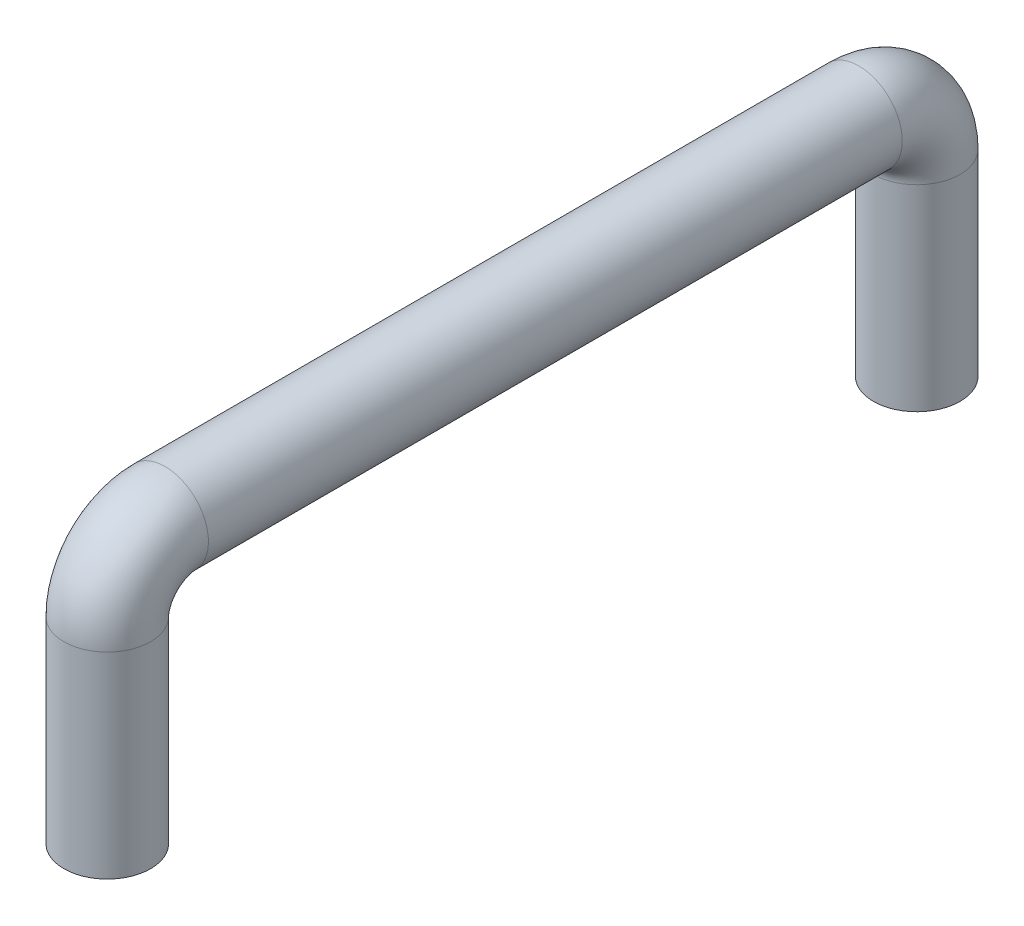
ISO-10303-21;
HEADER;
FILE_DESCRIPTION(('STEP AP214'),'2;1');
FILE_NAME('part.step','',(''),(''),'','','');
FILE_SCHEMA(('AUTOMOTIVE_DESIGN { 1 0 10303 214 1 1 1 1 }'));
ENDSEC;
DATA;
#1=APPLICATION_CONTEXT('core data for automotive mechanical design processes');
#2=APPLICATION_PROTOCOL_DEFINITION('international standard','automotive_design',2000,#1);
#3=PRODUCT_CONTEXT('',#1,'mechanical');
#4=PRODUCT('Part','Part','',(#3));
#5=PRODUCT_RELATED_PRODUCT_CATEGORY('part','',(#4));
#6=PRODUCT_DEFINITION_FORMATION('','',#4);
#7=PRODUCT_DEFINITION_CONTEXT('part definition',#1,'design');
#8=PRODUCT_DEFINITION('design','',#6,#7);
#9=PRODUCT_DEFINITION_SHAPE('','',#8);
#10=(LENGTH_UNIT() NAMED_UNIT(*) SI_UNIT(.MILLI.,.METRE.));
#11=(NAMED_UNIT(*) PLANE_ANGLE_UNIT() SI_UNIT($,.RADIAN.));
#12=(NAMED_UNIT(*) SI_UNIT($,.STERADIAN.) SOLID_ANGLE_UNIT());
#13=UNCERTAINTY_MEASURE_WITH_UNIT(LENGTH_MEASURE(1.E-05),#10,'distance_accuracy_value','');
#14=(GEOMETRIC_REPRESENTATION_CONTEXT(3) GLOBAL_UNCERTAINTY_ASSIGNED_CONTEXT((#13)) GLOBAL_UNIT_ASSIGNED_CONTEXT((#10,
#11,#12)) REPRESENTATION_CONTEXT('',''));
#15=CARTESIAN_POINT('',(0.,0.,0.));
#16=DIRECTION('',(0.,0.,1.));
#17=DIRECTION('',(1.,0.,0.));
#18=AXIS2_PLACEMENT_3D('',#15,#16,#17);
#19=CARTESIAN_POINT('',(0.,21.59,-88.9));
#20=DIRECTION('',(0.,-1.,0.));
#21=DIRECTION('',(0.,0.,-1.));
#22=AXIS2_PLACEMENT_3D('',#19,#20,#21);
#23=CYLINDRICAL_SURFACE('',#22,4.7625);
#24=CARTESIAN_POINT('',(0.,21.59,-88.9));
#25=DIRECTION('',(0.,-1.,0.));
#26=DIRECTION('',(0.,0.,-1.));
#27=AXIS2_PLACEMENT_3D('',#24,#25,#26);
#28=CIRCLE('',#27,4.7625);
#29=CARTESIAN_POINT('',(0.,21.59,-93.6625));
#30=VERTEX_POINT('',#29);
#31=EDGE_CURVE('E42',#30,#30,#28,.T.);
#32=ORIENTED_EDGE('',*,*,#31,.T.);
#33=EDGE_LOOP('',(#32));
#34=FACE_BOUND('',#33,.T.);
#35=CARTESIAN_POINT('',(0.,0.,-88.9));
#36=DIRECTION('',(0.,-1.,0.));
#37=DIRECTION('',(0.,0.,-1.));
#38=AXIS2_PLACEMENT_3D('',#35,#36,#37);
#39=CIRCLE('',#38,4.7625);
#40=CARTESIAN_POINT('',(0.,0.,-93.6625));
#41=VERTEX_POINT('',#40);
#42=EDGE_CURVE('E10',#41,#41,#39,.T.);
#43=ORIENTED_EDGE('',*,*,#42,.F.);
#44=EDGE_LOOP('',(#43));
#45=FACE_BOUND('',#44,.T.);
#46=ADVANCED_FACE('F36',(#34,#45),#23,.T.);
#47=CARTESIAN_POINT('',(0.,21.59,-82.55));
#48=DIRECTION('',(-1.,0.,0.));
#49=DIRECTION('',(0.,0.,1.));
#50=AXIS2_PLACEMENT_3D('',#47,#48,#49);
#51=TOROIDAL_SURFACE('',#50,6.34999999999999,4.7625);
#52=CARTESIAN_POINT('',(0.,27.94,-82.55));
#53=DIRECTION('',(0.,0.,-1.));
#54=DIRECTION('',(0.,1.,0.));
#55=AXIS2_PLACEMENT_3D('',#52,#53,#54);
#56=CIRCLE('',#55,4.7625);
#57=CARTESIAN_POINT('',(0.,32.7025,-82.55));
#58=VERTEX_POINT('',#57);
#59=EDGE_CURVE('E46',#58,#58,#56,.T.);
#60=CARTESIAN_POINT('',(0.,21.59,-82.55));
#61=DIRECTION('',(-1.,0.,0.));
#62=DIRECTION('',(0.,0.,1.));
#63=AXIS2_PLACEMENT_3D('',#60,#61,#62);
#64=CIRCLE('',#63,11.1125);
#65=EDGE_CURVE('',#58,#30,#64,.T.);
#66=ORIENTED_EDGE('',*,*,#59,.T.);
#67=ORIENTED_EDGE('',*,*,#31,.F.);
#68=ORIENTED_EDGE('',*,*,#65,.T.);
#69=ORIENTED_EDGE('',*,*,#65,.F.);
#70=EDGE_LOOP('',(#66,#68,#67,#69));
#71=FACE_BOUND('',#70,.T.);
#72=ADVANCED_FACE('F92',(#71),#51,.T.);
#73=CARTESIAN_POINT('',(0.,27.94,-6.35));
#74=DIRECTION('',(0.,0.,-1.));
#75=DIRECTION('',(-1.,0.,0.));
#76=AXIS2_PLACEMENT_3D('',#73,#74,#75);
#77=CYLINDRICAL_SURFACE('',#76,4.7625);
#78=CARTESIAN_POINT('',(0.,27.94,-6.35));
#79=DIRECTION('',(0.,0.,-1.));
#80=DIRECTION('',(0.,1.,0.));
#81=AXIS2_PLACEMENT_3D('',#78,#79,#80);
#82=CIRCLE('',#81,4.7625);
#83=CARTESIAN_POINT('',(0.,32.7025,-6.35));
#84=VERTEX_POINT('',#83);
#85=EDGE_CURVE('E50',#84,#84,#82,.T.);
#86=ORIENTED_EDGE('',*,*,#85,.T.);
#87=EDGE_LOOP('',(#86));
#88=FACE_BOUND('',#87,.T.);
#89=ORIENTED_EDGE('',*,*,#59,.F.);
#90=EDGE_LOOP('',(#89));
#91=FACE_BOUND('',#90,.T.);
#92=ADVANCED_FACE('F96',(#88,#91),#77,.T.);
#93=CARTESIAN_POINT('',(0.,21.59,-6.35));
#94=DIRECTION('',(-1.,0.,0.));
#95=DIRECTION('',(0.,0.,1.));
#96=AXIS2_PLACEMENT_3D('',#93,#94,#95);
#97=TOROIDAL_SURFACE('',#96,6.35,4.7625);
#98=CARTESIAN_POINT('',(0.,21.59,0.));
#99=DIRECTION('',(0.,1.,0.));
#100=DIRECTION('',(0.,0.,1.));
#101=AXIS2_PLACEMENT_3D('',#98,#99,#100);
#102=CIRCLE('',#101,4.7625);
#103=CARTESIAN_POINT('',(0.,21.59,4.7625));
#104=VERTEX_POINT('',#103);
#105=EDGE_CURVE('E55',#104,#104,#102,.T.);
#106=CARTESIAN_POINT('',(0.,21.59,-6.35));
#107=DIRECTION('',(-1.,0.,0.));
#108=DIRECTION('',(0.,0.,1.));
#109=AXIS2_PLACEMENT_3D('',#106,#107,#108);
#110=CIRCLE('',#109,11.1125);
#111=EDGE_CURVE('',#104,#84,#110,.T.);
#112=ORIENTED_EDGE('',*,*,#105,.T.);
#113=ORIENTED_EDGE('',*,*,#85,.F.);
#114=ORIENTED_EDGE('',*,*,#111,.T.);
#115=ORIENTED_EDGE('',*,*,#111,.F.);
#116=EDGE_LOOP('',(#112,#114,#113,#115));
#117=FACE_BOUND('',#116,.T.);
#118=ADVANCED_FACE('F88',(#117),#97,.T.);
#119=CARTESIAN_POINT('',(0.,21.59,0.));
#120=DIRECTION('',(0.,-1.,0.));
#121=DIRECTION('',(0.,0.,-1.));
#122=AXIS2_PLACEMENT_3D('',#119,#120,#121);
#123=CYLINDRICAL_SURFACE('',#122,4.7625);
#124=ORIENTED_EDGE('',*,*,#105,.F.);
#125=EDGE_LOOP('',(#124));
#126=FACE_BOUND('',#125,.T.);
#127=CARTESIAN_POINT('',(0.,0.,0.));
#128=DIRECTION('',(0.,1.,0.));
#129=DIRECTION('',(0.,0.,1.));
#130=AXIS2_PLACEMENT_3D('',#127,#128,#129);
#131=CIRCLE('',#130,4.7625);
#132=CARTESIAN_POINT('',(0.,0.,4.7625));
#133=VERTEX_POINT('',#132);
#134=EDGE_CURVE('E58',#133,#133,#131,.T.);
#135=ORIENTED_EDGE('',*,*,#134,.T.);
#136=EDGE_LOOP('',(#135));
#137=FACE_BOUND('',#136,.T.);
#138=ADVANCED_FACE('F79',(#126,#137),#123,.T.);
#139=CARTESIAN_POINT('',(0.,0.,-88.9));
#140=DIRECTION('',(0.,-1.,0.));
#141=DIRECTION('',(0.,0.,-1.));
#142=AXIS2_PLACEMENT_3D('',#139,#140,#141);
#143=PLANE('',#142);
#144=CARTESIAN_POINT('',(0.,0.,-88.9));
#145=DIRECTION('',(0.,-1.,0.));
#146=DIRECTION('',(0.,0.,-1.));
#147=AXIS2_PLACEMENT_3D('',#144,#145,#146);
#148=CIRCLE('',#147,1.7272);
#149=CARTESIAN_POINT('',(0.,0.,-90.6272));
#150=VERTEX_POINT('',#149);
#151=EDGE_CURVE('E70',#150,#150,#148,.T.);
#152=ORIENTED_EDGE('',*,*,#151,.F.);
#153=EDGE_LOOP('',(#152));
#154=FACE_BOUND('',#153,.T.);
#155=ORIENTED_EDGE('',*,*,#42,.T.);
#156=EDGE_LOOP('',(#155));
#157=FACE_BOUND('',#156,.T.);
#158=ADVANCED_FACE('F76',(#154,#157),#143,.T.);
#159=CARTESIAN_POINT('',(0.,0.,0.));
#160=DIRECTION('',(0.,1.,0.));
#161=DIRECTION('',(0.,0.,1.));
#162=AXIS2_PLACEMENT_3D('',#159,#160,#161);
#163=PLANE('',#162);
#164=CARTESIAN_POINT('',(0.,0.,0.));
#165=DIRECTION('',(0.,-1.,0.));
#166=DIRECTION('',(0.,0.,-1.));
#167=AXIS2_PLACEMENT_3D('',#164,#165,#166);
#168=CIRCLE('',#167,1.7272);
#169=CARTESIAN_POINT('',(0.,0.,-1.7272));
#170=VERTEX_POINT('',#169);
#171=EDGE_CURVE('E64',#170,#170,#168,.T.);
#172=ORIENTED_EDGE('',*,*,#171,.F.);
#173=EDGE_LOOP('',(#172));
#174=FACE_BOUND('',#173,.T.);
#175=ORIENTED_EDGE('',*,*,#134,.F.);
#176=EDGE_LOOP('',(#175));
#177=FACE_BOUND('',#176,.T.);
#178=ADVANCED_FACE('F78',(#174,#177),#163,.F.);
#179=CARTESIAN_POINT('',(0.,12.7,0.));
#180=DIRECTION('',(0.,-1.,0.));
#181=DIRECTION('',(0.,0.,-1.));
#182=AXIS2_PLACEMENT_3D('',#179,#180,#181);
#183=CYLINDRICAL_SURFACE('',#182,1.7272);
#184=CARTESIAN_POINT('',(0.,12.7,0.));
#185=DIRECTION('',(0.,-1.,0.));
#186=DIRECTION('',(0.,0.,-1.));
#187=AXIS2_PLACEMENT_3D('',#184,#185,#186);
#188=CIRCLE('',#187,1.7272);
#189=CARTESIAN_POINT('',(0.,12.7,-1.7272));
#190=VERTEX_POINT('',#189);
#191=EDGE_CURVE('E61',#190,#190,#188,.T.);
#192=ORIENTED_EDGE('',*,*,#191,.F.);
#193=EDGE_LOOP('',(#192));
#194=FACE_BOUND('',#193,.T.);
#195=ORIENTED_EDGE('',*,*,#171,.T.);
#196=EDGE_LOOP('',(#195));
#197=FACE_BOUND('',#196,.T.);
#198=ADVANCED_FACE('F85',(#194,#197),#183,.F.);
#199=CARTESIAN_POINT('',(0.,12.7,0.));
#200=DIRECTION('',(0.,-1.,0.));
#201=DIRECTION('',(0.,0.,-1.));
#202=AXIS2_PLACEMENT_3D('',#199,#200,#201);
#203=PLANE('',#202);
#204=ORIENTED_EDGE('',*,*,#191,.T.);
#205=EDGE_LOOP('',(#204));
#206=FACE_BOUND('',#205,.T.);
#207=ADVANCED_FACE('F143',(#206),#203,.T.);
#208=CARTESIAN_POINT('',(0.,12.7,-88.9));
#209=DIRECTION('',(0.,-1.,0.));
#210=DIRECTION('',(0.,0.,-1.));
#211=AXIS2_PLACEMENT_3D('',#208,#209,#210);
#212=CYLINDRICAL_SURFACE('',#211,1.7272);
#213=CARTESIAN_POINT('',(0.,12.7,-88.9));
#214=DIRECTION('',(0.,-1.,0.));
#215=DIRECTION('',(0.,0.,-1.));
#216=AXIS2_PLACEMENT_3D('',#213,#214,#215);
#217=CIRCLE('',#216,1.7272);
#218=CARTESIAN_POINT('',(0.,12.7,-90.6272));
#219=VERTEX_POINT('',#218);
#220=EDGE_CURVE('E67',#219,#219,#217,.T.);
#221=ORIENTED_EDGE('',*,*,#220,.F.);
#222=EDGE_LOOP('',(#221));
#223=FACE_BOUND('',#222,.T.);
#224=ORIENTED_EDGE('',*,*,#151,.T.);
#225=EDGE_LOOP('',(#224));
#226=FACE_BOUND('',#225,.T.);
#227=ADVANCED_FACE('F74',(#223,#226),#212,.F.);
#228=CARTESIAN_POINT('',(0.,12.7,-88.9));
#229=DIRECTION('',(0.,-1.,0.));
#230=DIRECTION('',(0.,0.,-1.));
#231=AXIS2_PLACEMENT_3D('',#228,#229,#230);
#232=PLANE('',#231);
#233=ORIENTED_EDGE('',*,*,#220,.T.);
#234=EDGE_LOOP('',(#233));
#235=FACE_BOUND('',#234,.T.);
#236=ADVANCED_FACE('F162',(#235),#232,.T.);
#237=CLOSED_SHELL('',(#46,#72,#92,#118,#138,#158,#178,#198,#207,#227,#236));
#238=MANIFOLD_SOLID_BREP('B2',#237);
#239=ADVANCED_BREP_SHAPE_REPRESENTATION('',(#18,#238),#14);
#240=SHAPE_DEFINITION_REPRESENTATION(#9,#239);
ENDSEC;
END-ISO-10303-21;
